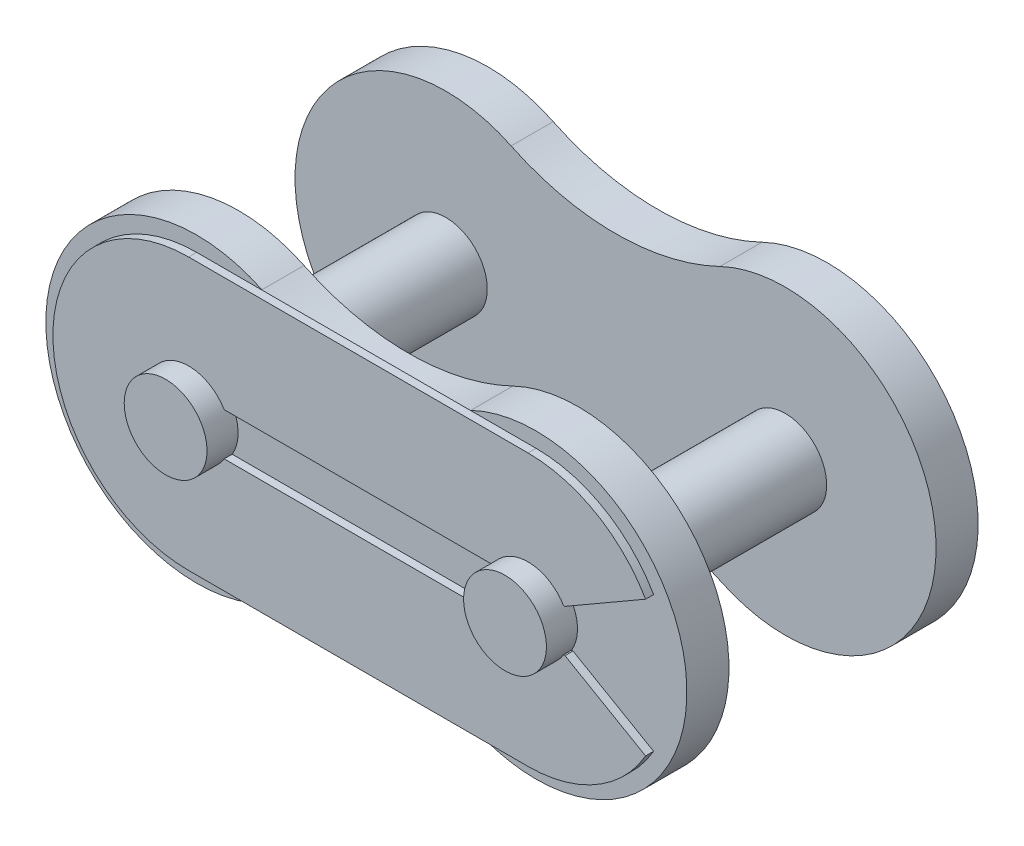
ISO-10303-21;
HEADER;
FILE_DESCRIPTION(('STEP AP214'),'2;1');
FILE_NAME('part.step','',(''),(''),'','','');
FILE_SCHEMA(('AUTOMOTIVE_DESIGN { 1 0 10303 214 1 1 1 1 }'));
ENDSEC;
DATA;
#1=APPLICATION_CONTEXT('core data for automotive mechanical design processes');
#2=APPLICATION_PROTOCOL_DEFINITION('international standard','automotive_design',2000,#1);
#3=PRODUCT_CONTEXT('',#1,'mechanical');
#4=PRODUCT('Part','Part','',(#3));
#5=PRODUCT_RELATED_PRODUCT_CATEGORY('part','',(#4));
#6=PRODUCT_DEFINITION_FORMATION('','',#4);
#7=PRODUCT_DEFINITION_CONTEXT('part definition',#1,'design');
#8=PRODUCT_DEFINITION('design','',#6,#7);
#9=PRODUCT_DEFINITION_SHAPE('','',#8);
#10=(LENGTH_UNIT() NAMED_UNIT(*) SI_UNIT(.MILLI.,.METRE.));
#11=(NAMED_UNIT(*) PLANE_ANGLE_UNIT() SI_UNIT($,.RADIAN.));
#12=(NAMED_UNIT(*) SI_UNIT($,.STERADIAN.) SOLID_ANGLE_UNIT());
#13=UNCERTAINTY_MEASURE_WITH_UNIT(LENGTH_MEASURE(1.E-05),#10,'distance_accuracy_value','');
#14=(GEOMETRIC_REPRESENTATION_CONTEXT(3) GLOBAL_UNCERTAINTY_ASSIGNED_CONTEXT((#13)) GLOBAL_UNIT_ASSIGNED_CONTEXT((#10,
#11,#12)) REPRESENTATION_CONTEXT('',''));
#15=CARTESIAN_POINT('',(0.,0.,0.));
#16=DIRECTION('',(0.,0.,1.));
#17=DIRECTION('',(1.,0.,0.));
#18=AXIS2_PLACEMENT_3D('',#15,#16,#17);
#19=CARTESIAN_POINT('',(0.,0.,6.6125));
#20=DIRECTION('',(0.,0.,1.));
#21=DIRECTION('',(1.,0.,0.));
#22=AXIS2_PLACEMENT_3D('',#19,#20,#21);
#23=PLANE('',#22);
#24=CARTESIAN_POINT('',(12.7,0.,6.6125));
#25=DIRECTION('',(0.,0.,-1.));
#26=DIRECTION('',(-1.,0.,0.));
#27=AXIS2_PLACEMENT_3D('',#24,#25,#26);
#28=CIRCLE('',#27,1.55);
#29=CARTESIAN_POINT('',(11.15,0.,6.6125));
#30=VERTEX_POINT('',#29);
#31=EDGE_CURVE('E20',#30,#30,#28,.T.);
#32=ORIENTED_EDGE('',*,*,#31,.F.);
#33=EDGE_LOOP('',(#32));
#34=FACE_BOUND('',#33,.T.);
#35=ADVANCED_FACE('F16',(#34),#23,.T.);
#36=CARTESIAN_POINT('',(0.,0.,6.6125));
#37=DIRECTION('',(0.,0.,1.));
#38=DIRECTION('',(1.,0.,0.));
#39=AXIS2_PLACEMENT_3D('',#36,#37,#38);
#40=PLANE('',#39);
#41=CARTESIAN_POINT('',(0.,0.,6.6125));
#42=DIRECTION('',(0.,0.,-1.));
#43=DIRECTION('',(-1.,0.,0.));
#44=AXIS2_PLACEMENT_3D('',#41,#42,#43);
#45=CIRCLE('',#44,1.55);
#46=CARTESIAN_POINT('',(-1.55,0.,6.6125));
#47=VERTEX_POINT('',#46);
#48=EDGE_CURVE('E190',#47,#47,#45,.T.);
#49=ORIENTED_EDGE('',*,*,#48,.F.);
#50=EDGE_LOOP('',(#49));
#51=FACE_BOUND('',#50,.T.);
#52=ADVANCED_FACE('F805',(#51),#40,.T.);
#53=CARTESIAN_POINT('',(0.,0.,5.45));
#54=DIRECTION('',(0.,0.,1.));
#55=DIRECTION('',(1.,0.,0.));
#56=AXIS2_PLACEMENT_3D('',#53,#54,#55);
#57=PLANE('',#56);
#58=CARTESIAN_POINT('',(12.7,0.,5.45));
#59=DIRECTION('',(0.,0.,-1.));
#60=DIRECTION('',(-1.,0.,0.));
#61=AXIS2_PLACEMENT_3D('',#58,#59,#60);
#62=CIRCLE('',#61,1.55);
#63=CARTESIAN_POINT('',(11.3710549531677,0.79775,5.45));
#64=VERTEX_POINT('',#63);
#65=CARTESIAN_POINT('',(11.3710549531677,-0.79775,5.45));
#66=VERTEX_POINT('',#65);
#67=EDGE_CURVE('E169',#64,#66,#62,.F.);
#68=ORIENTED_EDGE('',*,*,#67,.F.);
#69=DIRECTION('',(1.,0.,0.));
#70=VECTOR('',#69,1.);
#71=CARTESIAN_POINT('',(14.0817435317381,0.79775,5.45));
#72=LINE('',#71,#70);
#73=CARTESIAN_POINT('',(1.32894504683226,0.79775,5.45));
#74=VERTEX_POINT('',#73);
#75=EDGE_CURVE('E173',#74,#64,#72,.T.);
#76=ORIENTED_EDGE('',*,*,#75,.F.);
#77=CARTESIAN_POINT('',(0.,0.,5.45));
#78=DIRECTION('',(0.,0.,-1.));
#79=DIRECTION('',(-1.,0.,0.));
#80=AXIS2_PLACEMENT_3D('',#77,#78,#79);
#81=CIRCLE('',#80,1.55);
#82=CARTESIAN_POINT('',(1.32894504683226,-0.79775,5.45));
#83=VERTEX_POINT('',#82);
#84=EDGE_CURVE('E321',#83,#74,#81,.F.);
#85=ORIENTED_EDGE('',*,*,#84,.F.);
#86=DIRECTION('',(1.,0.,0.));
#87=VECTOR('',#86,1.);
#88=CARTESIAN_POINT('',(0.,-0.79775,5.45));
#89=LINE('',#88,#87);
#90=EDGE_CURVE('E176',#66,#83,#89,.F.);
#91=ORIENTED_EDGE('',*,*,#90,.F.);
#92=EDGE_LOOP('',(#68,#76,#85,#91));
#93=FACE_BOUND('',#92,.T.);
#94=ADVANCED_FACE('F171',(#93),#57,.T.);
#95=CARTESIAN_POINT('',(12.7,0.,6.6125));
#96=DIRECTION('',(0.,0.,-1.));
#97=DIRECTION('',(-1.,0.,0.));
#98=AXIS2_PLACEMENT_3D('',#95,#96,#97);
#99=CYLINDRICAL_SURFACE('',#98,1.55);
#100=ORIENTED_EDGE('',*,*,#31,.T.);
#101=EDGE_LOOP('',(#100));
#102=FACE_BOUND('',#101,.T.);
#103=DIRECTION('',(0.,0.,-1.));
#104=VECTOR('',#103,1.);
#105=CARTESIAN_POINT('',(14.0289450468323,-0.797749999999981,6.6125));
#106=LINE('',#105,#104);
#107=CARTESIAN_POINT('',(14.0289450468323,-0.797749999999991,5.75));
#108=VERTEX_POINT('',#107);
#109=CARTESIAN_POINT('',(14.0289450468323,-0.797749999999991,5.45));
#110=VERTEX_POINT('',#109);
#111=EDGE_CURVE('E179',#108,#110,#106,.T.);
#112=ORIENTED_EDGE('',*,*,#111,.T.);
#113=CARTESIAN_POINT('',(12.7,0.,5.45));
#114=DIRECTION('',(0.,0.,-1.));
#115=DIRECTION('',(-1.,0.,0.));
#116=AXIS2_PLACEMENT_3D('',#113,#114,#115);
#117=CIRCLE('',#116,1.55);
#118=CARTESIAN_POINT('',(14.0289450468323,0.797749999999991,5.45));
#119=VERTEX_POINT('',#118);
#120=EDGE_CURVE('E323',#110,#119,#117,.F.);
#121=ORIENTED_EDGE('',*,*,#120,.T.);
#122=DIRECTION('',(0.,0.,-1.));
#123=VECTOR('',#122,1.);
#124=CARTESIAN_POINT('',(14.0289450468323,0.797749999999982,6.6125));
#125=LINE('',#124,#123);
#126=CARTESIAN_POINT('',(14.0289450468323,0.797749999999991,5.75));
#127=VERTEX_POINT('',#126);
#128=EDGE_CURVE('E199',#119,#127,#125,.F.);
#129=ORIENTED_EDGE('',*,*,#128,.T.);
#130=CARTESIAN_POINT('',(12.7,0.,5.75));
#131=DIRECTION('',(0.,0.,-1.));
#132=DIRECTION('',(-1.,0.,0.));
#133=AXIS2_PLACEMENT_3D('',#130,#131,#132);
#134=CIRCLE('',#133,1.55);
#135=CARTESIAN_POINT('',(11.3710549531677,0.79775,5.75));
#136=VERTEX_POINT('',#135);
#137=EDGE_CURVE('E185',#136,#127,#134,.T.);
#138=ORIENTED_EDGE('',*,*,#137,.F.);
#139=DIRECTION('',(0.,0.,-1.));
#140=VECTOR('',#139,1.);
#141=CARTESIAN_POINT('',(11.3710549531677,0.79775,5.45));
#142=LINE('',#141,#140);
#143=EDGE_CURVE('E181',#64,#136,#142,.F.);
#144=ORIENTED_EDGE('',*,*,#143,.F.);
#145=ORIENTED_EDGE('',*,*,#67,.T.);
#146=DIRECTION('',(0.,0.,1.));
#147=VECTOR('',#146,1.);
#148=CARTESIAN_POINT('',(11.3710549531677,-0.79775,5.45));
#149=LINE('',#148,#147);
#150=CARTESIAN_POINT('',(11.3710549531677,-0.79775,5.75));
#151=VERTEX_POINT('',#150);
#152=EDGE_CURVE('E202',#151,#66,#149,.F.);
#153=ORIENTED_EDGE('',*,*,#152,.F.);
#154=CARTESIAN_POINT('',(12.7,0.,5.75));
#155=DIRECTION('',(0.,0.,-1.));
#156=DIRECTION('',(-1.,0.,0.));
#157=AXIS2_PLACEMENT_3D('',#154,#155,#156);
#158=CIRCLE('',#157,1.55);
#159=EDGE_CURVE('E194',#108,#151,#158,.T.);
#160=ORIENTED_EDGE('',*,*,#159,.F.);
#161=EDGE_LOOP('',(#112,#121,#129,#138,#144,#145,#153,#160));
#162=FACE_BOUND('',#161,.T.);
#163=ADVANCED_FACE('F183',(#102,#162),#99,.T.);
#164=CARTESIAN_POINT('',(0.,-0.79775,5.45));
#165=DIRECTION('',(0.,1.,0.));
#166=DIRECTION('',(0.,0.,1.));
#167=AXIS2_PLACEMENT_3D('',#164,#165,#166);
#168=PLANE('',#167);
#169=ORIENTED_EDGE('',*,*,#152,.T.);
#170=ORIENTED_EDGE('',*,*,#90,.T.);
#171=DIRECTION('',(0.,0.,-1.));
#172=VECTOR('',#171,1.);
#173=CARTESIAN_POINT('',(1.32894504683226,-0.79775,6.6125));
#174=LINE('',#173,#172);
#175=CARTESIAN_POINT('',(1.32894504683226,-0.79775,5.75));
#176=VERTEX_POINT('',#175);
#177=EDGE_CURVE('E201',#176,#83,#174,.T.);
#178=ORIENTED_EDGE('',*,*,#177,.F.);
#179=DIRECTION('',(1.,0.,0.));
#180=VECTOR('',#179,1.);
#181=CARTESIAN_POINT('',(0.,-0.79775,5.75));
#182=LINE('',#181,#180);
#183=EDGE_CURVE('E316',#151,#176,#182,.F.);
#184=ORIENTED_EDGE('',*,*,#183,.F.);
#185=EDGE_LOOP('',(#169,#170,#178,#184));
#186=FACE_BOUND('',#185,.T.);
#187=ADVANCED_FACE('F435',(#186),#168,.T.);
#188=CARTESIAN_POINT('',(0.,0.,6.6125));
#189=DIRECTION('',(0.,0.,-1.));
#190=DIRECTION('',(-1.,0.,0.));
#191=AXIS2_PLACEMENT_3D('',#188,#189,#190);
#192=CYLINDRICAL_SURFACE('',#191,1.55);
#193=ORIENTED_EDGE('',*,*,#177,.T.);
#194=ORIENTED_EDGE('',*,*,#84,.T.);
#195=DIRECTION('',(0.,0.,-1.));
#196=VECTOR('',#195,1.);
#197=CARTESIAN_POINT('',(1.32894504683226,0.79775,5.45));
#198=LINE('',#197,#196);
#199=CARTESIAN_POINT('',(1.32894504683226,0.79775,5.75));
#200=VERTEX_POINT('',#199);
#201=EDGE_CURVE('E189',#200,#74,#198,.T.);
#202=ORIENTED_EDGE('',*,*,#201,.F.);
#203=CARTESIAN_POINT('',(0.,0.,5.75));
#204=DIRECTION('',(0.,0.,-1.));
#205=DIRECTION('',(-1.,0.,0.));
#206=AXIS2_PLACEMENT_3D('',#203,#204,#205);
#207=CIRCLE('',#206,1.55);
#208=EDGE_CURVE('E312',#176,#200,#207,.T.);
#209=ORIENTED_EDGE('',*,*,#208,.F.);
#210=EDGE_LOOP('',(#193,#194,#202,#209));
#211=FACE_BOUND('',#210,.T.);
#212=ORIENTED_EDGE('',*,*,#48,.T.);
#213=EDGE_LOOP('',(#212));
#214=FACE_BOUND('',#213,.T.);
#215=ADVANCED_FACE('F432',(#211,#214),#192,.T.);
#216=CARTESIAN_POINT('',(14.0817435317381,0.79775,5.45));
#217=DIRECTION('',(0.,-1.,0.));
#218=DIRECTION('',(0.,0.,-1.));
#219=AXIS2_PLACEMENT_3D('',#216,#217,#218);
#220=PLANE('',#219);
#221=ORIENTED_EDGE('',*,*,#201,.T.);
#222=ORIENTED_EDGE('',*,*,#75,.T.);
#223=ORIENTED_EDGE('',*,*,#143,.T.);
#224=DIRECTION('',(1.,0.,0.));
#225=VECTOR('',#224,1.);
#226=CARTESIAN_POINT('',(0.,0.79775,5.75));
#227=LINE('',#226,#225);
#228=EDGE_CURVE('E315',#200,#136,#227,.T.);
#229=ORIENTED_EDGE('',*,*,#228,.F.);
#230=EDGE_LOOP('',(#221,#222,#223,#229));
#231=FACE_BOUND('',#230,.T.);
#232=ADVANCED_FACE('F192',(#231),#220,.T.);
#233=CARTESIAN_POINT('',(0.,0.,5.75));
#234=DIRECTION('',(0.,0.,1.));
#235=DIRECTION('',(1.,0.,0.));
#236=AXIS2_PLACEMENT_3D('',#233,#234,#235);
#237=PLANE('',#236);
#238=ORIENTED_EDGE('',*,*,#208,.T.);
#239=ORIENTED_EDGE('',*,*,#228,.T.);
#240=ORIENTED_EDGE('',*,*,#137,.T.);
#241=DIRECTION('',(1.,0.,0.));
#242=VECTOR('',#241,1.);
#243=CARTESIAN_POINT('',(14.0817435317381,0.79775,5.75));
#244=LINE('',#243,#242);
#245=CARTESIAN_POINT('',(14.0817435317381,0.797750000000007,5.75));
#246=VERTEX_POINT('',#245);
#247=EDGE_CURVE('E337',#246,#127,#244,.F.);
#248=ORIENTED_EDGE('',*,*,#247,.F.);
#249=DIRECTION('',(0.866025403784438,0.500000000000001,0.));
#250=VECTOR('',#249,1.);
#251=CARTESIAN_POINT('',(17.0994523524951,2.54002499999998,5.75));
#252=LINE('',#251,#250);
#253=CARTESIAN_POINT('',(17.0994523524951,2.54002499999999,5.75));
#254=VERTEX_POINT('',#253);
#255=EDGE_CURVE('E306',#254,#246,#252,.F.);
#256=ORIENTED_EDGE('',*,*,#255,.F.);
#257=CARTESIAN_POINT('',(12.7,0.,5.75));
#258=DIRECTION('',(0.,0.,1.));
#259=DIRECTION('',(1.,0.,0.));
#260=AXIS2_PLACEMENT_3D('',#257,#258,#259);
#261=CIRCLE('',#260,5.08005);
#262=CARTESIAN_POINT('',(12.7,5.08005,5.75));
#263=VERTEX_POINT('',#262);
#264=EDGE_CURVE('E303',#263,#254,#261,.F.);
#265=ORIENTED_EDGE('',*,*,#264,.F.);
#266=DIRECTION('',(1.,0.,0.));
#267=VECTOR('',#266,1.);
#268=CARTESIAN_POINT('',(0.,5.08005,5.75));
#269=LINE('',#268,#267);
#270=CARTESIAN_POINT('',(0.,5.08005,5.75));
#271=VERTEX_POINT('',#270);
#272=EDGE_CURVE('E351',#271,#263,#269,.T.);
#273=ORIENTED_EDGE('',*,*,#272,.F.);
#274=CARTESIAN_POINT('',(0.,0.,5.75));
#275=DIRECTION('',(0.,0.,1.));
#276=DIRECTION('',(1.,0.,0.));
#277=AXIS2_PLACEMENT_3D('',#274,#275,#276);
#278=CIRCLE('',#277,5.08005);
#279=CARTESIAN_POINT('',(0.,-5.08005,5.75));
#280=VERTEX_POINT('',#279);
#281=EDGE_CURVE('E298',#280,#271,#278,.F.);
#282=ORIENTED_EDGE('',*,*,#281,.F.);
#283=DIRECTION('',(1.,0.,0.));
#284=VECTOR('',#283,1.);
#285=CARTESIAN_POINT('',(12.7,-5.08005,5.75));
#286=LINE('',#285,#284);
#287=CARTESIAN_POINT('',(12.7,-5.08005,5.75));
#288=VERTEX_POINT('',#287);
#289=EDGE_CURVE('E356',#288,#280,#286,.F.);
#290=ORIENTED_EDGE('',*,*,#289,.F.);
#291=CARTESIAN_POINT('',(12.7,0.,5.75));
#292=DIRECTION('',(0.,0.,1.));
#293=DIRECTION('',(1.,0.,0.));
#294=AXIS2_PLACEMENT_3D('',#291,#292,#293);
#295=CIRCLE('',#294,5.08005);
#296=CARTESIAN_POINT('',(17.0994523524951,-2.540025,5.75));
#297=VERTEX_POINT('',#296);
#298=EDGE_CURVE('E308',#297,#288,#295,.F.);
#299=ORIENTED_EDGE('',*,*,#298,.F.);
#300=DIRECTION('',(-0.866025403784439,0.5,0.));
#301=VECTOR('',#300,1.);
#302=CARTESIAN_POINT('',(14.0817435317381,-0.79775,5.75));
#303=LINE('',#302,#301);
#304=CARTESIAN_POINT('',(14.0817435317381,-0.79775,5.75));
#305=VERTEX_POINT('',#304);
#306=EDGE_CURVE('E336',#305,#297,#303,.F.);
#307=ORIENTED_EDGE('',*,*,#306,.F.);
#308=DIRECTION('',(1.,0.,0.));
#309=VECTOR('',#308,1.);
#310=CARTESIAN_POINT('',(0.,-0.79775,5.75));
#311=LINE('',#310,#309);
#312=EDGE_CURVE('E333',#108,#305,#311,.T.);
#313=ORIENTED_EDGE('',*,*,#312,.F.);
#314=ORIENTED_EDGE('',*,*,#159,.T.);
#315=ORIENTED_EDGE('',*,*,#183,.T.);
#316=EDGE_LOOP('',(#238,#239,#240,#248,#256,#265,#273,#282,#290,#299,#307,#313,#314,#315));
#317=FACE_BOUND('',#316,.T.);
#318=ADVANCED_FACE('F427',(#317),#237,.T.);
#319=CARTESIAN_POINT('',(14.0817435317381,0.79775,5.45));
#320=DIRECTION('',(0.,-1.,0.));
#321=DIRECTION('',(0.,0.,-1.));
#322=AXIS2_PLACEMENT_3D('',#319,#320,#321);
#323=PLANE('',#322);
#324=DIRECTION('',(0.,0.,1.));
#325=VECTOR('',#324,1.);
#326=CARTESIAN_POINT('',(14.0817435317381,0.797750000000011,5.45));
#327=LINE('',#326,#325);
#328=CARTESIAN_POINT('',(14.0817435317381,0.797750000000004,5.45));
#329=VERTEX_POINT('',#328);
#330=EDGE_CURVE('E350',#246,#329,#327,.F.);
#331=ORIENTED_EDGE('',*,*,#330,.F.);
#332=ORIENTED_EDGE('',*,*,#247,.T.);
#333=ORIENTED_EDGE('',*,*,#128,.F.);
#334=DIRECTION('',(1.,0.,0.));
#335=VECTOR('',#334,1.);
#336=CARTESIAN_POINT('',(0.,0.79775,5.45));
#337=LINE('',#336,#335);
#338=EDGE_CURVE('E403',#329,#119,#337,.F.);
#339=ORIENTED_EDGE('',*,*,#338,.F.);
#340=EDGE_LOOP('',(#331,#332,#333,#339));
#341=FACE_BOUND('',#340,.T.);
#342=ADVANCED_FACE('F453',(#341),#323,.T.);
#343=CARTESIAN_POINT('',(0.,-0.79775,5.45));
#344=DIRECTION('',(0.,1.,0.));
#345=DIRECTION('',(0.,0.,1.));
#346=AXIS2_PLACEMENT_3D('',#343,#344,#345);
#347=PLANE('',#346);
#348=DIRECTION('',(0.,0.,1.));
#349=VECTOR('',#348,1.);
#350=CARTESIAN_POINT('',(14.0817435317381,-0.79775,5.45));
#351=LINE('',#350,#349);
#352=CARTESIAN_POINT('',(14.0817435317381,-0.797750000000002,5.45));
#353=VERTEX_POINT('',#352);
#354=EDGE_CURVE('E311',#353,#305,#351,.T.);
#355=ORIENTED_EDGE('',*,*,#354,.F.);
#356=DIRECTION('',(1.,0.,0.));
#357=VECTOR('',#356,1.);
#358=CARTESIAN_POINT('',(0.,-0.79775,5.45));
#359=LINE('',#358,#357);
#360=EDGE_CURVE('E406',#110,#353,#359,.T.);
#361=ORIENTED_EDGE('',*,*,#360,.F.);
#362=ORIENTED_EDGE('',*,*,#111,.F.);
#363=ORIENTED_EDGE('',*,*,#312,.T.);
#364=EDGE_LOOP('',(#355,#361,#362,#363));
#365=FACE_BOUND('',#364,.T.);
#366=ADVANCED_FACE('F440',(#365),#347,.T.);
#367=CARTESIAN_POINT('',(14.0817435317381,-0.79775,5.45));
#368=DIRECTION('',(0.5,0.866025403784439,0.));
#369=DIRECTION('',(-0.866025403784439,0.5,0.));
#370=AXIS2_PLACEMENT_3D('',#367,#368,#369);
#371=PLANE('',#370);
#372=DIRECTION('',(0.866025403784435,-0.500000000000006,0.));
#373=VECTOR('',#372,1.);
#374=CARTESIAN_POINT('',(14.0817435317381,-0.79775,5.45));
#375=LINE('',#374,#373);
#376=CARTESIAN_POINT('',(17.0994523524951,-2.54002500000001,5.45));
#377=VERTEX_POINT('',#376);
#378=EDGE_CURVE('E297',#353,#377,#375,.T.);
#379=ORIENTED_EDGE('',*,*,#378,.F.);
#380=ORIENTED_EDGE('',*,*,#354,.T.);
#381=ORIENTED_EDGE('',*,*,#306,.T.);
#382=DIRECTION('',(0.,0.,1.));
#383=VECTOR('',#382,1.);
#384=CARTESIAN_POINT('',(17.0994523524951,-2.54002500000001,5.45));
#385=LINE('',#384,#383);
#386=EDGE_CURVE('E307',#377,#297,#385,.T.);
#387=ORIENTED_EDGE('',*,*,#386,.F.);
#388=EDGE_LOOP('',(#379,#380,#381,#387));
#389=FACE_BOUND('',#388,.T.);
#390=ADVANCED_FACE('F444',(#389),#371,.T.);
#391=CARTESIAN_POINT('',(12.7,0.,5.45));
#392=DIRECTION('',(0.,0.,1.));
#393=DIRECTION('',(1.,0.,0.));
#394=AXIS2_PLACEMENT_3D('',#391,#392,#393);
#395=CYLINDRICAL_SURFACE('',#394,5.08005);
#396=CARTESIAN_POINT('',(12.7,0.,5.45));
#397=DIRECTION('',(0.,0.,1.));
#398=DIRECTION('',(1.,0.,0.));
#399=AXIS2_PLACEMENT_3D('',#396,#397,#398);
#400=CIRCLE('',#399,5.08005);
#401=CARTESIAN_POINT('',(12.7,-5.08005,5.45));
#402=VERTEX_POINT('',#401);
#403=EDGE_CURVE('E294',#377,#402,#400,.F.);
#404=ORIENTED_EDGE('',*,*,#403,.F.);
#405=ORIENTED_EDGE('',*,*,#386,.T.);
#406=ORIENTED_EDGE('',*,*,#298,.T.);
#407=DIRECTION('',(0.,0.,-1.));
#408=VECTOR('',#407,1.);
#409=CARTESIAN_POINT('',(12.7,-5.08005,5.45));
#410=LINE('',#409,#408);
#411=EDGE_CURVE('E302',#402,#288,#410,.F.);
#412=ORIENTED_EDGE('',*,*,#411,.F.);
#413=EDGE_LOOP('',(#404,#405,#406,#412));
#414=FACE_BOUND('',#413,.T.);
#415=ADVANCED_FACE('F732',(#414),#395,.T.);
#416=CARTESIAN_POINT('',(12.7,0.,5.45));
#417=DIRECTION('',(0.,0.,1.));
#418=DIRECTION('',(1.,0.,0.));
#419=AXIS2_PLACEMENT_3D('',#416,#417,#418);
#420=CYLINDRICAL_SURFACE('',#419,5.08005);
#421=CARTESIAN_POINT('',(12.7,0.,5.45));
#422=DIRECTION('',(0.,0.,1.));
#423=DIRECTION('',(1.,0.,0.));
#424=AXIS2_PLACEMENT_3D('',#421,#422,#423);
#425=CIRCLE('',#424,5.08005);
#426=CARTESIAN_POINT('',(12.7,5.08005,5.45));
#427=VERTEX_POINT('',#426);
#428=CARTESIAN_POINT('',(17.0994523524951,2.54002499999999,5.45));
#429=VERTEX_POINT('',#428);
#430=EDGE_CURVE('E285',#427,#429,#425,.F.);
#431=ORIENTED_EDGE('',*,*,#430,.F.);
#432=DIRECTION('',(0.,0.,1.));
#433=VECTOR('',#432,1.);
#434=CARTESIAN_POINT('',(12.7,5.08005,5.45));
#435=LINE('',#434,#433);
#436=EDGE_CURVE('E354',#263,#427,#435,.F.);
#437=ORIENTED_EDGE('',*,*,#436,.F.);
#438=ORIENTED_EDGE('',*,*,#264,.T.);
#439=DIRECTION('',(0.,0.,1.));
#440=VECTOR('',#439,1.);
#441=CARTESIAN_POINT('',(17.0994523524951,2.54002499999998,5.45));
#442=LINE('',#441,#440);
#443=EDGE_CURVE('E355',#429,#254,#442,.T.);
#444=ORIENTED_EDGE('',*,*,#443,.F.);
#445=EDGE_LOOP('',(#431,#437,#438,#444));
#446=FACE_BOUND('',#445,.T.);
#447=ADVANCED_FACE('F460',(#446),#420,.T.);
#448=CARTESIAN_POINT('',(17.0994523524951,2.54002499999998,5.45));
#449=DIRECTION('',(0.500000000000001,-0.866025403784438,0.));
#450=DIRECTION('',(0.866025403784438,0.500000000000001,0.));
#451=AXIS2_PLACEMENT_3D('',#448,#449,#450);
#452=PLANE('',#451);
#453=DIRECTION('',(-0.866025403784436,-0.500000000000004,0.));
#454=VECTOR('',#453,1.);
#455=CARTESIAN_POINT('',(17.0994523524951,2.54002499999998,5.45));
#456=LINE('',#455,#454);
#457=EDGE_CURVE('E288',#429,#329,#456,.T.);
#458=ORIENTED_EDGE('',*,*,#457,.F.);
#459=ORIENTED_EDGE('',*,*,#443,.T.);
#460=ORIENTED_EDGE('',*,*,#255,.T.);
#461=ORIENTED_EDGE('',*,*,#330,.T.);
#462=EDGE_LOOP('',(#458,#459,#460,#461));
#463=FACE_BOUND('',#462,.T.);
#464=ADVANCED_FACE('F456',(#463),#452,.T.);
#465=CARTESIAN_POINT('',(0.,5.08005,5.45));
#466=DIRECTION('',(0.,1.,0.));
#467=DIRECTION('',(0.,0.,1.));
#468=AXIS2_PLACEMENT_3D('',#465,#466,#467);
#469=PLANE('',#468);
#470=DIRECTION('',(1.,0.,0.));
#471=VECTOR('',#470,1.);
#472=CARTESIAN_POINT('',(0.,5.08005,5.45));
#473=LINE('',#472,#471);
#474=CARTESIAN_POINT('',(0.,5.08005,5.45));
#475=VERTEX_POINT('',#474);
#476=CARTESIAN_POINT('',(2.4605150527117,5.08005000000001,5.45));
#477=VERTEX_POINT('',#476);
#478=EDGE_CURVE('E394',#475,#477,#473,.T.);
#479=ORIENTED_EDGE('',*,*,#478,.F.);
#480=DIRECTION('',(0.,0.,1.));
#481=VECTOR('',#480,1.);
#482=CARTESIAN_POINT('',(0.,5.08005,5.45));
#483=LINE('',#482,#481);
#484=EDGE_CURVE('E301',#271,#475,#483,.F.);
#485=ORIENTED_EDGE('',*,*,#484,.F.);
#486=ORIENTED_EDGE('',*,*,#272,.T.);
#487=ORIENTED_EDGE('',*,*,#436,.T.);
#488=DIRECTION('',(1.,0.,0.));
#489=VECTOR('',#488,1.);
#490=CARTESIAN_POINT('',(0.,5.08005,5.45));
#491=LINE('',#490,#489);
#492=CARTESIAN_POINT('',(10.2394849472884,5.08005,5.45));
#493=VERTEX_POINT('',#492);
#494=EDGE_CURVE('E289',#493,#427,#491,.T.);
#495=ORIENTED_EDGE('',*,*,#494,.F.);
#496=DIRECTION('',(1.,0.,0.));
#497=VECTOR('',#496,1.);
#498=CARTESIAN_POINT('',(0.,5.08005,5.45));
#499=LINE('',#498,#497);
#500=EDGE_CURVE('E397',#493,#477,#499,.F.);
#501=ORIENTED_EDGE('',*,*,#500,.T.);
#502=EDGE_LOOP('',(#479,#485,#486,#487,#495,#501));
#503=FACE_BOUND('',#502,.T.);
#504=ADVANCED_FACE('F463',(#503),#469,.T.);
#505=CARTESIAN_POINT('',(12.7,-5.08005,5.45));
#506=DIRECTION('',(0.,-1.,0.));
#507=DIRECTION('',(0.,0.,-1.));
#508=AXIS2_PLACEMENT_3D('',#505,#506,#507);
#509=PLANE('',#508);
#510=DIRECTION('',(1.,0.,0.));
#511=VECTOR('',#510,1.);
#512=CARTESIAN_POINT('',(0.,-5.08005,5.45));
#513=LINE('',#512,#511);
#514=CARTESIAN_POINT('',(10.2394849472883,-5.08005,5.45));
#515=VERTEX_POINT('',#514);
#516=EDGE_CURVE('E293',#402,#515,#513,.F.);
#517=ORIENTED_EDGE('',*,*,#516,.F.);
#518=ORIENTED_EDGE('',*,*,#411,.T.);
#519=ORIENTED_EDGE('',*,*,#289,.T.);
#520=DIRECTION('',(0.,0.,1.));
#521=VECTOR('',#520,1.);
#522=CARTESIAN_POINT('',(0.,-5.08005,5.45));
#523=LINE('',#522,#521);
#524=CARTESIAN_POINT('',(0.,-5.08005,5.45));
#525=VERTEX_POINT('',#524);
#526=EDGE_CURVE('E374',#525,#280,#523,.T.);
#527=ORIENTED_EDGE('',*,*,#526,.F.);
#528=DIRECTION('',(1.,0.,0.));
#529=VECTOR('',#528,1.);
#530=CARTESIAN_POINT('',(0.,-5.08005,5.45));
#531=LINE('',#530,#529);
#532=CARTESIAN_POINT('',(2.46051505271168,-5.08005,5.45));
#533=VERTEX_POINT('',#532);
#534=EDGE_CURVE('E284',#533,#525,#531,.F.);
#535=ORIENTED_EDGE('',*,*,#534,.F.);
#536=DIRECTION('',(1.,0.,0.));
#537=VECTOR('',#536,1.);
#538=CARTESIAN_POINT('',(0.,-5.08005,5.45));
#539=LINE('',#538,#537);
#540=EDGE_CURVE('E377',#533,#515,#539,.T.);
#541=ORIENTED_EDGE('',*,*,#540,.T.);
#542=EDGE_LOOP('',(#517,#518,#519,#527,#535,#541));
#543=FACE_BOUND('',#542,.T.);
#544=ADVANCED_FACE('F467',(#543),#509,.T.);
#545=CARTESIAN_POINT('',(0.,0.,5.45));
#546=DIRECTION('',(0.,0.,1.));
#547=DIRECTION('',(1.,0.,0.));
#548=AXIS2_PLACEMENT_3D('',#545,#546,#547);
#549=CYLINDRICAL_SURFACE('',#548,5.08005);
#550=CARTESIAN_POINT('',(0.,0.,5.45));
#551=DIRECTION('',(0.,0.,1.));
#552=DIRECTION('',(1.,0.,0.));
#553=AXIS2_PLACEMENT_3D('',#550,#551,#552);
#554=CIRCLE('',#553,5.08005);
#555=EDGE_CURVE('E281',#525,#475,#554,.F.);
#556=ORIENTED_EDGE('',*,*,#555,.F.);
#557=ORIENTED_EDGE('',*,*,#526,.T.);
#558=ORIENTED_EDGE('',*,*,#281,.T.);
#559=ORIENTED_EDGE('',*,*,#484,.T.);
#560=EDGE_LOOP('',(#556,#557,#558,#559));
#561=FACE_BOUND('',#560,.T.);
#562=ADVANCED_FACE('F469',(#561),#549,.T.);
#563=CARTESIAN_POINT('',(0.,0.,-6.6125));
#564=DIRECTION('',(0.,0.,1.));
#565=DIRECTION('',(1.,0.,0.));
#566=AXIS2_PLACEMENT_3D('',#563,#564,#565);
#567=PLANE('',#566);
#568=CARTESIAN_POINT('',(12.7,0.,-6.6125));
#569=DIRECTION('',(0.,0.,-1.));
#570=DIRECTION('',(-1.,0.,0.));
#571=AXIS2_PLACEMENT_3D('',#568,#569,#570);
#572=CIRCLE('',#571,1.55);
#573=CARTESIAN_POINT('',(11.15,0.,-6.6125));
#574=VERTEX_POINT('',#573);
#575=EDGE_CURVE('E278',#574,#574,#572,.F.);
#576=ORIENTED_EDGE('',*,*,#575,.F.);
#577=EDGE_LOOP('',(#576));
#578=FACE_BOUND('',#577,.T.);
#579=ADVANCED_FACE('F687',(#578),#567,.F.);
#580=CARTESIAN_POINT('',(0.,0.,-6.6125));
#581=DIRECTION('',(0.,0.,1.));
#582=DIRECTION('',(1.,0.,0.));
#583=AXIS2_PLACEMENT_3D('',#580,#581,#582);
#584=PLANE('',#583);
#585=CARTESIAN_POINT('',(0.,0.,-6.6125));
#586=DIRECTION('',(0.,0.,-1.));
#587=DIRECTION('',(-1.,0.,0.));
#588=AXIS2_PLACEMENT_3D('',#585,#586,#587);
#589=CIRCLE('',#588,1.55);
#590=CARTESIAN_POINT('',(-1.55,0.,-6.6125));
#591=VERTEX_POINT('',#590);
#592=EDGE_CURVE('E275',#591,#591,#589,.F.);
#593=ORIENTED_EDGE('',*,*,#592,.F.);
#594=EDGE_LOOP('',(#593));
#595=FACE_BOUND('',#594,.T.);
#596=ADVANCED_FACE('F679',(#595),#584,.F.);
#597=CARTESIAN_POINT('',(0.,0.,5.45));
#598=DIRECTION('',(0.,0.,1.));
#599=DIRECTION('',(1.,0.,0.));
#600=AXIS2_PLACEMENT_3D('',#597,#598,#599);
#601=PLANE('',#600);
#602=ORIENTED_EDGE('',*,*,#540,.F.);
#603=CARTESIAN_POINT('',(6.35,-13.2307849536602,5.45));
#604=DIRECTION('',(0.,0.,1.));
#605=DIRECTION('',(1.,0.,0.));
#606=AXIS2_PLACEMENT_3D('',#603,#604,#605);
#607=CIRCLE('',#606,9.03120000000002);
#608=EDGE_CURVE('E269',#533,#515,#607,.F.);
#609=ORIENTED_EDGE('',*,*,#608,.T.);
#610=EDGE_LOOP('',(#602,#609));
#611=FACE_BOUND('',#610,.T.);
#612=ADVANCED_FACE('F476',(#611),#601,.F.);
#613=CARTESIAN_POINT('',(0.,0.,5.45));
#614=DIRECTION('',(0.,0.,1.));
#615=DIRECTION('',(1.,0.,0.));
#616=AXIS2_PLACEMENT_3D('',#613,#614,#615);
#617=PLANE('',#616);
#618=ORIENTED_EDGE('',*,*,#430,.T.);
#619=ORIENTED_EDGE('',*,*,#457,.T.);
#620=ORIENTED_EDGE('',*,*,#338,.T.);
#621=ORIENTED_EDGE('',*,*,#120,.F.);
#622=ORIENTED_EDGE('',*,*,#360,.T.);
#623=ORIENTED_EDGE('',*,*,#378,.T.);
#624=ORIENTED_EDGE('',*,*,#403,.T.);
#625=ORIENTED_EDGE('',*,*,#516,.T.);
#626=CARTESIAN_POINT('',(6.35,-13.2307849536602,5.45));
#627=DIRECTION('',(0.,0.,1.));
#628=DIRECTION('',(1.,0.,0.));
#629=AXIS2_PLACEMENT_3D('',#626,#627,#628);
#630=CIRCLE('',#629,9.03120000000002);
#631=CARTESIAN_POINT('',(10.2576923076923,-5.08876344371545,5.45));
#632=VERTEX_POINT('',#631);
#633=EDGE_CURVE('E267',#515,#632,#630,.F.);
#634=ORIENTED_EDGE('',*,*,#633,.T.);
#635=CARTESIAN_POINT('',(12.7,0.,5.45));
#636=DIRECTION('',(0.,0.,1.));
#637=DIRECTION('',(1.,0.,0.));
#638=AXIS2_PLACEMENT_3D('',#635,#636,#637);
#639=CIRCLE('',#638,5.6445);
#640=CARTESIAN_POINT('',(10.2576922418792,5.08876341212903,5.45));
#641=VERTEX_POINT('',#640);
#642=EDGE_CURVE('E263',#641,#632,#639,.F.);
#643=ORIENTED_EDGE('',*,*,#642,.F.);
#644=CARTESIAN_POINT('',(6.35000000000001,13.2307849536602,5.45));
#645=DIRECTION('',(0.,0.,1.));
#646=DIRECTION('',(1.,0.,0.));
#647=AXIS2_PLACEMENT_3D('',#644,#645,#646);
#648=CIRCLE('',#647,9.03120000000002);
#649=EDGE_CURVE('E290',#641,#493,#648,.F.);
#650=ORIENTED_EDGE('',*,*,#649,.T.);
#651=ORIENTED_EDGE('',*,*,#494,.T.);
#652=EDGE_LOOP('',(#618,#619,#620,#621,#622,#623,#624,#625,#634,#643,#650,#651));
#653=FACE_BOUND('',#652,.T.);
#654=ADVANCED_FACE('F448',(#653),#617,.T.);
#655=CARTESIAN_POINT('',(0.,0.,5.45));
#656=DIRECTION('',(0.,0.,1.));
#657=DIRECTION('',(1.,0.,0.));
#658=AXIS2_PLACEMENT_3D('',#655,#656,#657);
#659=PLANE('',#658);
#660=ORIENTED_EDGE('',*,*,#500,.F.);
#661=CARTESIAN_POINT('',(6.35000000000001,13.2307849536602,5.45));
#662=DIRECTION('',(0.,0.,1.));
#663=DIRECTION('',(1.,0.,0.));
#664=AXIS2_PLACEMENT_3D('',#661,#662,#663);
#665=CIRCLE('',#664,9.03120000000002);
#666=EDGE_CURVE('E259',#493,#477,#665,.F.);
#667=ORIENTED_EDGE('',*,*,#666,.T.);
#668=EDGE_LOOP('',(#660,#667));
#669=FACE_BOUND('',#668,.T.);
#670=ADVANCED_FACE('F495',(#669),#659,.F.);
#671=CARTESIAN_POINT('',(0.,0.,5.45));
#672=DIRECTION('',(0.,0.,1.));
#673=DIRECTION('',(1.,0.,0.));
#674=AXIS2_PLACEMENT_3D('',#671,#672,#673);
#675=PLANE('',#674);
#676=ORIENTED_EDGE('',*,*,#534,.T.);
#677=ORIENTED_EDGE('',*,*,#555,.T.);
#678=ORIENTED_EDGE('',*,*,#478,.T.);
#679=CARTESIAN_POINT('',(6.35000000000001,13.2307849536602,5.45));
#680=DIRECTION('',(0.,0.,1.));
#681=DIRECTION('',(1.,0.,0.));
#682=AXIS2_PLACEMENT_3D('',#679,#680,#681);
#683=CIRCLE('',#682,9.03120000000002);
#684=CARTESIAN_POINT('',(2.4423076923077,5.08876344371546,5.45));
#685=VERTEX_POINT('',#684);
#686=EDGE_CURVE('E257',#477,#685,#683,.F.);
#687=ORIENTED_EDGE('',*,*,#686,.T.);
#688=CARTESIAN_POINT('',(0.,0.,5.45));
#689=DIRECTION('',(0.,0.,1.));
#690=DIRECTION('',(1.,0.,0.));
#691=AXIS2_PLACEMENT_3D('',#688,#689,#690);
#692=CIRCLE('',#691,5.6445);
#693=CARTESIAN_POINT('',(2.44230775812081,-5.08876341212901,5.45));
#694=VERTEX_POINT('',#693);
#695=EDGE_CURVE('E253',#694,#685,#692,.F.);
#696=ORIENTED_EDGE('',*,*,#695,.F.);
#697=CARTESIAN_POINT('',(6.35,-13.2307849536602,5.45));
#698=DIRECTION('',(0.,0.,1.));
#699=DIRECTION('',(1.,0.,0.));
#700=AXIS2_PLACEMENT_3D('',#697,#698,#699);
#701=CIRCLE('',#700,9.03120000000002);
#702=EDGE_CURVE('E272',#694,#533,#701,.F.);
#703=ORIENTED_EDGE('',*,*,#702,.T.);
#704=EDGE_LOOP('',(#676,#677,#678,#687,#696,#703));
#705=FACE_BOUND('',#704,.T.);
#706=ADVANCED_FACE('F471',(#705),#675,.T.);
#707=CARTESIAN_POINT('',(12.7,0.,6.6125));
#708=DIRECTION('',(0.,0.,-1.));
#709=DIRECTION('',(-1.,0.,0.));
#710=AXIS2_PLACEMENT_3D('',#707,#708,#709);
#711=CYLINDRICAL_SURFACE('',#710,1.55);
#712=CARTESIAN_POINT('',(12.7,0.,-5.45));
#713=DIRECTION('',(0.,0.,-1.));
#714=DIRECTION('',(-1.,0.,0.));
#715=AXIS2_PLACEMENT_3D('',#712,#713,#714);
#716=CIRCLE('',#715,1.55);
#717=CARTESIAN_POINT('',(11.15,0.,-5.45));
#718=VERTEX_POINT('',#717);
#719=EDGE_CURVE('E249',#718,#718,#716,.T.);
#720=ORIENTED_EDGE('',*,*,#719,.T.);
#721=EDGE_LOOP('',(#720));
#722=FACE_BOUND('',#721,.T.);
#723=ORIENTED_EDGE('',*,*,#575,.T.);
#724=EDGE_LOOP('',(#723));
#725=FACE_BOUND('',#724,.T.);
#726=ADVANCED_FACE('F641',(#722,#725),#711,.T.);
#727=CARTESIAN_POINT('',(0.,0.,6.6125));
#728=DIRECTION('',(0.,0.,-1.));
#729=DIRECTION('',(-1.,0.,0.));
#730=AXIS2_PLACEMENT_3D('',#727,#728,#729);
#731=CYLINDRICAL_SURFACE('',#730,1.55);
#732=ORIENTED_EDGE('',*,*,#592,.T.);
#733=EDGE_LOOP('',(#732));
#734=FACE_BOUND('',#733,.T.);
#735=CARTESIAN_POINT('',(0.,0.,-5.45));
#736=DIRECTION('',(0.,0.,-1.));
#737=DIRECTION('',(-1.,0.,0.));
#738=AXIS2_PLACEMENT_3D('',#735,#736,#737);
#739=CIRCLE('',#738,1.55);
#740=CARTESIAN_POINT('',(-1.55,0.,-5.45));
#741=VERTEX_POINT('',#740);
#742=EDGE_CURVE('E246',#741,#741,#739,.T.);
#743=ORIENTED_EDGE('',*,*,#742,.T.);
#744=EDGE_LOOP('',(#743));
#745=FACE_BOUND('',#744,.T.);
#746=ADVANCED_FACE('F633',(#734,#745),#731,.T.);
#747=CARTESIAN_POINT('',(6.35,-13.2307849536602,3.875));
#748=DIRECTION('',(0.,0.,1.));
#749=DIRECTION('',(1.,0.,0.));
#750=AXIS2_PLACEMENT_3D('',#747,#748,#749);
#751=CYLINDRICAL_SURFACE('',#750,9.03120000000002);
#752=ORIENTED_EDGE('',*,*,#608,.F.);
#753=ORIENTED_EDGE('',*,*,#702,.F.);
#754=DIRECTION('',(0.,0.,1.));
#755=VECTOR('',#754,1.);
#756=CARTESIAN_POINT('',(2.44230782393394,-5.08876338054257,3.875));
#757=LINE('',#756,#755);
#758=CARTESIAN_POINT('',(2.44230775812081,-5.08876341212901,3.875));
#759=VERTEX_POINT('',#758);
#760=EDGE_CURVE('E252',#759,#694,#757,.T.);
#761=ORIENTED_EDGE('',*,*,#760,.F.);
#762=CARTESIAN_POINT('',(6.35,-13.2307849536602,3.875));
#763=DIRECTION('',(0.,0.,1.));
#764=DIRECTION('',(1.,0.,0.));
#765=AXIS2_PLACEMENT_3D('',#762,#763,#764);
#766=CIRCLE('',#765,9.03120000000002);
#767=CARTESIAN_POINT('',(10.2576923076923,-5.08876344371545,3.875));
#768=VERTEX_POINT('',#767);
#769=EDGE_CURVE('E244',#759,#768,#766,.F.);
#770=ORIENTED_EDGE('',*,*,#769,.T.);
#771=DIRECTION('',(0.,0.,1.));
#772=VECTOR('',#771,1.);
#773=CARTESIAN_POINT('',(10.2576923076923,-5.08876344371544,3.875));
#774=LINE('',#773,#772);
#775=EDGE_CURVE('E266',#632,#768,#774,.F.);
#776=ORIENTED_EDGE('',*,*,#775,.F.);
#777=ORIENTED_EDGE('',*,*,#633,.F.);
#778=EDGE_LOOP('',(#752,#753,#761,#770,#776,#777));
#779=FACE_BOUND('',#778,.T.);
#780=ADVANCED_FACE('F481',(#779),#751,.F.);
#781=CARTESIAN_POINT('',(12.7,0.,3.875));
#782=DIRECTION('',(0.,0.,1.));
#783=DIRECTION('',(1.,0.,0.));
#784=AXIS2_PLACEMENT_3D('',#781,#782,#783);
#785=CYLINDRICAL_SURFACE('',#784,5.6445);
#786=CARTESIAN_POINT('',(12.7,0.,3.875));
#787=DIRECTION('',(0.,0.,1.));
#788=DIRECTION('',(1.,0.,0.));
#789=AXIS2_PLACEMENT_3D('',#786,#787,#788);
#790=CIRCLE('',#789,5.6445);
#791=CARTESIAN_POINT('',(10.2576922418792,5.08876341212903,3.875));
#792=VERTEX_POINT('',#791);
#793=EDGE_CURVE('E242',#768,#792,#790,.T.);
#794=ORIENTED_EDGE('',*,*,#793,.T.);
#795=DIRECTION('',(0.,0.,1.));
#796=VECTOR('',#795,1.);
#797=CARTESIAN_POINT('',(10.2576921760661,5.08876338054261,3.875));
#798=LINE('',#797,#796);
#799=EDGE_CURVE('E262',#792,#641,#798,.T.);
#800=ORIENTED_EDGE('',*,*,#799,.T.);
#801=ORIENTED_EDGE('',*,*,#642,.T.);
#802=ORIENTED_EDGE('',*,*,#775,.T.);
#803=EDGE_LOOP('',(#794,#800,#801,#802));
#804=FACE_BOUND('',#803,.T.);
#805=ADVANCED_FACE('F485',(#804),#785,.T.);
#806=CARTESIAN_POINT('',(6.35000000000001,13.2307849536602,3.875));
#807=DIRECTION('',(0.,0.,1.));
#808=DIRECTION('',(1.,0.,0.));
#809=AXIS2_PLACEMENT_3D('',#806,#807,#808);
#810=CYLINDRICAL_SURFACE('',#809,9.03120000000002);
#811=ORIENTED_EDGE('',*,*,#666,.F.);
#812=ORIENTED_EDGE('',*,*,#649,.F.);
#813=ORIENTED_EDGE('',*,*,#799,.F.);
#814=CARTESIAN_POINT('',(6.35000000000001,13.2307849536602,3.875));
#815=DIRECTION('',(0.,0.,1.));
#816=DIRECTION('',(1.,0.,0.));
#817=AXIS2_PLACEMENT_3D('',#814,#815,#816);
#818=CIRCLE('',#817,9.03120000000002);
#819=CARTESIAN_POINT('',(2.4423076923077,5.08876344371546,3.875));
#820=VERTEX_POINT('',#819);
#821=EDGE_CURVE('E240',#792,#820,#818,.F.);
#822=ORIENTED_EDGE('',*,*,#821,.T.);
#823=DIRECTION('',(0.,0.,1.));
#824=VECTOR('',#823,1.);
#825=CARTESIAN_POINT('',(2.44230769230769,5.08876344371544,3.875));
#826=LINE('',#825,#824);
#827=EDGE_CURVE('E256',#685,#820,#826,.F.);
#828=ORIENTED_EDGE('',*,*,#827,.F.);
#829=ORIENTED_EDGE('',*,*,#686,.F.);
#830=EDGE_LOOP('',(#811,#812,#813,#822,#828,#829));
#831=FACE_BOUND('',#830,.T.);
#832=ADVANCED_FACE('F489',(#831),#810,.F.);
#833=CARTESIAN_POINT('',(0.,0.,3.875));
#834=DIRECTION('',(0.,0.,1.));
#835=DIRECTION('',(1.,0.,0.));
#836=AXIS2_PLACEMENT_3D('',#833,#834,#835);
#837=CYLINDRICAL_SURFACE('',#836,5.6445);
#838=CARTESIAN_POINT('',(0.,0.,3.875));
#839=DIRECTION('',(0.,0.,1.));
#840=DIRECTION('',(1.,0.,0.));
#841=AXIS2_PLACEMENT_3D('',#838,#839,#840);
#842=CIRCLE('',#841,5.6445);
#843=EDGE_CURVE('E237',#820,#759,#842,.T.);
#844=ORIENTED_EDGE('',*,*,#843,.T.);
#845=ORIENTED_EDGE('',*,*,#760,.T.);
#846=ORIENTED_EDGE('',*,*,#695,.T.);
#847=ORIENTED_EDGE('',*,*,#827,.T.);
#848=EDGE_LOOP('',(#844,#845,#846,#847));
#849=FACE_BOUND('',#848,.T.);
#850=ADVANCED_FACE('F498',(#849),#837,.T.);
#851=CARTESIAN_POINT('',(0.,0.,-5.45));
#852=DIRECTION('',(0.,0.,1.));
#853=DIRECTION('',(1.,0.,0.));
#854=AXIS2_PLACEMENT_3D('',#851,#852,#853);
#855=PLANE('',#854);
#856=ORIENTED_EDGE('',*,*,#742,.F.);
#857=EDGE_LOOP('',(#856));
#858=FACE_BOUND('',#857,.T.);
#859=ORIENTED_EDGE('',*,*,#719,.F.);
#860=EDGE_LOOP('',(#859));
#861=FACE_BOUND('',#860,.T.);
#862=CARTESIAN_POINT('',(0.,0.,-5.45));
#863=DIRECTION('',(0.,0.,-1.));
#864=DIRECTION('',(-1.,0.,0.));
#865=AXIS2_PLACEMENT_3D('',#862,#863,#864);
#866=CIRCLE('',#865,5.6445);
#867=CARTESIAN_POINT('',(2.4423076923077,5.08876344371546,-5.45));
#868=VERTEX_POINT('',#867);
#869=CARTESIAN_POINT('',(2.44230775812082,-5.08876341212902,-5.45));
#870=VERTEX_POINT('',#869);
#871=EDGE_CURVE('E235',#868,#870,#866,.F.);
#872=ORIENTED_EDGE('',*,*,#871,.F.);
#873=CARTESIAN_POINT('',(6.35000000000001,13.2307849536602,-5.45));
#874=DIRECTION('',(0.,0.,-1.));
#875=DIRECTION('',(-1.,0.,0.));
#876=AXIS2_PLACEMENT_3D('',#873,#874,#875);
#877=CIRCLE('',#876,9.03120000000002);
#878=CARTESIAN_POINT('',(10.2576922418792,5.08876341212903,-5.45));
#879=VERTEX_POINT('',#878);
#880=EDGE_CURVE('E224',#868,#879,#877,.F.);
#881=ORIENTED_EDGE('',*,*,#880,.T.);
#882=CARTESIAN_POINT('',(12.7,0.,-5.45));
#883=DIRECTION('',(0.,0.,-1.));
#884=DIRECTION('',(-1.,0.,0.));
#885=AXIS2_PLACEMENT_3D('',#882,#883,#884);
#886=CIRCLE('',#885,5.6445);
#887=CARTESIAN_POINT('',(10.2576923076923,-5.08876344371544,-5.45));
#888=VERTEX_POINT('',#887);
#889=EDGE_CURVE('E228',#888,#879,#886,.F.);
#890=ORIENTED_EDGE('',*,*,#889,.F.);
#891=CARTESIAN_POINT('',(6.35,-13.2307849536602,-5.45));
#892=DIRECTION('',(0.,0.,-1.));
#893=DIRECTION('',(-1.,0.,0.));
#894=AXIS2_PLACEMENT_3D('',#891,#892,#893);
#895=CIRCLE('',#894,9.03120000000002);
#896=EDGE_CURVE('E231',#888,#870,#895,.F.);
#897=ORIENTED_EDGE('',*,*,#896,.T.);
#898=EDGE_LOOP('',(#872,#881,#890,#897));
#899=FACE_BOUND('',#898,.T.);
#900=ADVANCED_FACE('F503',(#858,#861,#899),#855,.F.);
#901=CARTESIAN_POINT('',(0.,0.,3.875));
#902=DIRECTION('',(0.,0.,1.));
#903=DIRECTION('',(1.,0.,0.));
#904=AXIS2_PLACEMENT_3D('',#901,#902,#903);
#905=PLANE('',#904);
#906=CARTESIAN_POINT('',(0.,0.,3.875));
#907=DIRECTION('',(0.,0.,-1.));
#908=DIRECTION('',(-1.,0.,0.));
#909=AXIS2_PLACEMENT_3D('',#906,#907,#908);
#910=CIRCLE('',#909,1.55);
#911=CARTESIAN_POINT('',(-1.55,0.,3.875));
#912=VERTEX_POINT('',#911);
#913=EDGE_CURVE('E218',#912,#912,#910,.T.);
#914=ORIENTED_EDGE('',*,*,#913,.F.);
#915=EDGE_LOOP('',(#914));
#916=FACE_BOUND('',#915,.T.);
#917=CARTESIAN_POINT('',(12.7,0.,3.875));
#918=DIRECTION('',(0.,0.,-1.));
#919=DIRECTION('',(-1.,0.,0.));
#920=AXIS2_PLACEMENT_3D('',#917,#918,#919);
#921=CIRCLE('',#920,1.55);
#922=CARTESIAN_POINT('',(11.15,0.,3.875));
#923=VERTEX_POINT('',#922);
#924=EDGE_CURVE('E221',#923,#923,#921,.T.);
#925=ORIENTED_EDGE('',*,*,#924,.F.);
#926=EDGE_LOOP('',(#925));
#927=FACE_BOUND('',#926,.T.);
#928=ORIENTED_EDGE('',*,*,#821,.F.);
#929=ORIENTED_EDGE('',*,*,#793,.F.);
#930=ORIENTED_EDGE('',*,*,#769,.F.);
#931=ORIENTED_EDGE('',*,*,#843,.F.);
#932=EDGE_LOOP('',(#928,#929,#930,#931));
#933=FACE_BOUND('',#932,.T.);
#934=ADVANCED_FACE('F500',(#916,#927,#933),#905,.F.);
#935=CARTESIAN_POINT('',(0.,0.,-3.875));
#936=DIRECTION('',(0.,0.,-1.));
#937=DIRECTION('',(-1.,0.,0.));
#938=AXIS2_PLACEMENT_3D('',#935,#936,#937);
#939=CYLINDRICAL_SURFACE('',#938,5.6445);
#940=CARTESIAN_POINT('',(0.,0.,-3.875));
#941=DIRECTION('',(0.,0.,-1.));
#942=DIRECTION('',(-1.,0.,0.));
#943=AXIS2_PLACEMENT_3D('',#940,#941,#942);
#944=CIRCLE('',#943,5.6445);
#945=CARTESIAN_POINT('',(2.4423076923077,5.08876344371546,-3.875));
#946=VERTEX_POINT('',#945);
#947=CARTESIAN_POINT('',(2.44230775812082,-5.08876341212903,-3.875));
#948=VERTEX_POINT('',#947);
#949=EDGE_CURVE('E215',#946,#948,#944,.F.);
#950=ORIENTED_EDGE('',*,*,#949,.F.);
#951=DIRECTION('',(0.,0.,-1.));
#952=VECTOR('',#951,1.);
#953=CARTESIAN_POINT('',(2.44230769230771,5.08876344371547,-3.875));
#954=LINE('',#953,#952);
#955=EDGE_CURVE('E227',#946,#868,#954,.T.);
#956=ORIENTED_EDGE('',*,*,#955,.T.);
#957=ORIENTED_EDGE('',*,*,#871,.T.);
#958=DIRECTION('',(0.,0.,-1.));
#959=VECTOR('',#958,1.);
#960=CARTESIAN_POINT('',(2.44230782393395,-5.08876338054259,-3.875));
#961=LINE('',#960,#959);
#962=EDGE_CURVE('E234',#870,#948,#961,.F.);
#963=ORIENTED_EDGE('',*,*,#962,.T.);
#964=EDGE_LOOP('',(#950,#956,#957,#963));
#965=FACE_BOUND('',#964,.T.);
#966=ADVANCED_FACE('F502',(#965),#939,.T.);
#967=CARTESIAN_POINT('',(6.35,-13.2307849536602,-3.875));
#968=DIRECTION('',(0.,0.,-1.));
#969=DIRECTION('',(-1.,0.,0.));
#970=AXIS2_PLACEMENT_3D('',#967,#968,#969);
#971=CYLINDRICAL_SURFACE('',#970,9.03120000000002);
#972=DIRECTION('',(0.,0.,-1.));
#973=VECTOR('',#972,1.);
#974=CARTESIAN_POINT('',(10.2576923076923,-5.08876344371544,-3.875));
#975=LINE('',#974,#973);
#976=CARTESIAN_POINT('',(10.2576923076923,-5.08876344371544,-3.875));
#977=VERTEX_POINT('',#976);
#978=EDGE_CURVE('E230',#977,#888,#975,.T.);
#979=ORIENTED_EDGE('',*,*,#978,.F.);
#980=CARTESIAN_POINT('',(6.35,-13.2307849536602,-3.875));
#981=DIRECTION('',(0.,0.,-1.));
#982=DIRECTION('',(-1.,0.,0.));
#983=AXIS2_PLACEMENT_3D('',#980,#981,#982);
#984=CIRCLE('',#983,9.03120000000002);
#985=EDGE_CURVE('E212',#948,#977,#984,.T.);
#986=ORIENTED_EDGE('',*,*,#985,.F.);
#987=ORIENTED_EDGE('',*,*,#962,.F.);
#988=ORIENTED_EDGE('',*,*,#896,.F.);
#989=EDGE_LOOP('',(#979,#986,#987,#988));
#990=FACE_BOUND('',#989,.T.);
#991=ADVANCED_FACE('F511',(#990),#971,.F.);
#992=CARTESIAN_POINT('',(12.7,0.,-3.875));
#993=DIRECTION('',(0.,0.,-1.));
#994=DIRECTION('',(-1.,0.,0.));
#995=AXIS2_PLACEMENT_3D('',#992,#993,#994);
#996=CYLINDRICAL_SURFACE('',#995,5.6445);
#997=CARTESIAN_POINT('',(12.7,0.,-3.875));
#998=DIRECTION('',(0.,0.,-1.));
#999=DIRECTION('',(-1.,0.,0.));
#1000=AXIS2_PLACEMENT_3D('',#997,#998,#999);
#1001=CIRCLE('',#1000,5.6445);
#1002=CARTESIAN_POINT('',(10.2576922418792,5.08876341212903,-3.875));
#1003=VERTEX_POINT('',#1002);
#1004=EDGE_CURVE('E209',#977,#1003,#1001,.F.);
#1005=ORIENTED_EDGE('',*,*,#1004,.F.);
#1006=ORIENTED_EDGE('',*,*,#978,.T.);
#1007=ORIENTED_EDGE('',*,*,#889,.T.);
#1008=DIRECTION('',(0.,0.,-1.));
#1009=VECTOR('',#1008,1.);
#1010=CARTESIAN_POINT('',(10.2576921760661,5.08876338054261,-3.875));
#1011=LINE('',#1010,#1009);
#1012=EDGE_CURVE('E35',#879,#1003,#1011,.F.);
#1013=ORIENTED_EDGE('',*,*,#1012,.T.);
#1014=EDGE_LOOP('',(#1005,#1006,#1007,#1013));
#1015=FACE_BOUND('',#1014,.T.);
#1016=ADVANCED_FACE('F531',(#1015),#996,.T.);
#1017=CARTESIAN_POINT('',(6.35000000000001,13.2307849536602,-3.875));
#1018=DIRECTION('',(0.,0.,-1.));
#1019=DIRECTION('',(-1.,0.,0.));
#1020=AXIS2_PLACEMENT_3D('',#1017,#1018,#1019);
#1021=CYLINDRICAL_SURFACE('',#1020,9.03120000000002);
#1022=ORIENTED_EDGE('',*,*,#955,.F.);
#1023=CARTESIAN_POINT('',(6.35000000000001,13.2307849536602,-3.875));
#1024=DIRECTION('',(0.,0.,-1.));
#1025=DIRECTION('',(-1.,0.,0.));
#1026=AXIS2_PLACEMENT_3D('',#1023,#1024,#1025);
#1027=CIRCLE('',#1026,9.03120000000002);
#1028=EDGE_CURVE('E206',#1003,#946,#1027,.T.);
#1029=ORIENTED_EDGE('',*,*,#1028,.F.);
#1030=ORIENTED_EDGE('',*,*,#1012,.F.);
#1031=ORIENTED_EDGE('',*,*,#880,.F.);
#1032=EDGE_LOOP('',(#1022,#1029,#1030,#1031));
#1033=FACE_BOUND('',#1032,.T.);
#1034=ADVANCED_FACE('F539',(#1033),#1021,.F.);
#1035=CARTESIAN_POINT('',(12.7,0.,6.6125));
#1036=DIRECTION('',(0.,0.,-1.));
#1037=DIRECTION('',(-1.,0.,0.));
#1038=AXIS2_PLACEMENT_3D('',#1035,#1036,#1037);
#1039=CYLINDRICAL_SURFACE('',#1038,1.55);
#1040=ORIENTED_EDGE('',*,*,#924,.T.);
#1041=EDGE_LOOP('',(#1040));
#1042=FACE_BOUND('',#1041,.T.);
#1043=CARTESIAN_POINT('',(12.7,0.,-3.875));
#1044=DIRECTION('',(0.,0.,-1.));
#1045=DIRECTION('',(-1.,0.,0.));
#1046=AXIS2_PLACEMENT_3D('',#1043,#1044,#1045);
#1047=CIRCLE('',#1046,1.55);
#1048=CARTESIAN_POINT('',(11.15,0.,-3.875));
#1049=VERTEX_POINT('',#1048);
#1050=EDGE_CURVE('E26',#1049,#1049,#1047,.T.);
#1051=ORIENTED_EDGE('',*,*,#1050,.F.);
#1052=EDGE_LOOP('',(#1051));
#1053=FACE_BOUND('',#1052,.T.);
#1054=ADVANCED_FACE('F524',(#1042,#1053),#1039,.T.);
#1055=CARTESIAN_POINT('',(0.,0.,6.6125));
#1056=DIRECTION('',(0.,0.,-1.));
#1057=DIRECTION('',(-1.,0.,0.));
#1058=AXIS2_PLACEMENT_3D('',#1055,#1056,#1057);
#1059=CYLINDRICAL_SURFACE('',#1058,1.55);
#1060=CARTESIAN_POINT('',(0.,0.,-3.875));
#1061=DIRECTION('',(0.,0.,-1.));
#1062=DIRECTION('',(-1.,0.,0.));
#1063=AXIS2_PLACEMENT_3D('',#1060,#1061,#1062);
#1064=CIRCLE('',#1063,1.55);
#1065=CARTESIAN_POINT('',(-1.55,0.,-3.875));
#1066=VERTEX_POINT('',#1065);
#1067=EDGE_CURVE('E11',#1066,#1066,#1064,.T.);
#1068=ORIENTED_EDGE('',*,*,#1067,.F.);
#1069=EDGE_LOOP('',(#1068));
#1070=FACE_BOUND('',#1069,.T.);
#1071=ORIENTED_EDGE('',*,*,#913,.T.);
#1072=EDGE_LOOP('',(#1071));
#1073=FACE_BOUND('',#1072,.T.);
#1074=ADVANCED_FACE('F519',(#1070,#1073),#1059,.T.);
#1075=CARTESIAN_POINT('',(0.,0.,-3.875));
#1076=DIRECTION('',(0.,0.,1.));
#1077=DIRECTION('',(1.,0.,0.));
#1078=AXIS2_PLACEMENT_3D('',#1075,#1076,#1077);
#1079=PLANE('',#1078);
#1080=ORIENTED_EDGE('',*,*,#1067,.T.);
#1081=EDGE_LOOP('',(#1080));
#1082=FACE_BOUND('',#1081,.T.);
#1083=ORIENTED_EDGE('',*,*,#1050,.T.);
#1084=EDGE_LOOP('',(#1083));
#1085=FACE_BOUND('',#1084,.T.);
#1086=ORIENTED_EDGE('',*,*,#1004,.T.);
#1087=ORIENTED_EDGE('',*,*,#1028,.T.);
#1088=ORIENTED_EDGE('',*,*,#949,.T.);
#1089=ORIENTED_EDGE('',*,*,#985,.T.);
#1090=EDGE_LOOP('',(#1086,#1087,#1088,#1089));
#1091=FACE_BOUND('',#1090,.T.);
#1092=ADVANCED_FACE('F18',(#1082,#1085,#1091),#1079,.T.);
#1093=CLOSED_SHELL('',(#35,#52,#94,#163,#187,#215,#232,#318,#342,#366,#390,#415,#447,#464,#504,
#544,#562,#579,#596,#612,#654,#670,#706,#726,#746,#780,#805,#832,#850,#900,#934,#966,#991,#1016,
#1034,#1054,#1074,#1092));
#1094=MANIFOLD_SOLID_BREP('B1',#1093);
#1095=ADVANCED_BREP_SHAPE_REPRESENTATION('',(#18,#1094),#14);
#1096=SHAPE_DEFINITION_REPRESENTATION(#9,#1095);
ENDSEC;
END-ISO-10303-21;
